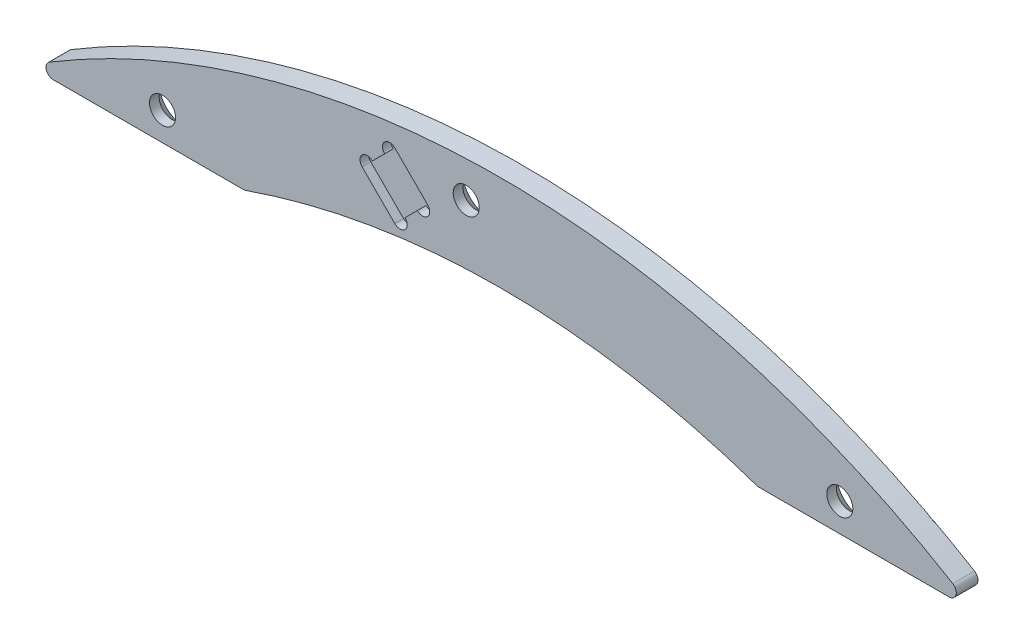
ISO-10303-21;
HEADER;
FILE_DESCRIPTION(('STEP AP214'),'2;1');
FILE_NAME('part.step','',(''),(''),'','','');
FILE_SCHEMA(('AUTOMOTIVE_DESIGN { 1 0 10303 214 1 1 1 1 }'));
ENDSEC;
DATA;
#1=APPLICATION_CONTEXT('core data for automotive mechanical design processes');
#2=APPLICATION_PROTOCOL_DEFINITION('international standard','automotive_design',2000,#1);
#3=PRODUCT_CONTEXT('',#1,'mechanical');
#4=PRODUCT('Part','Part','',(#3));
#5=PRODUCT_RELATED_PRODUCT_CATEGORY('part','',(#4));
#6=PRODUCT_DEFINITION_FORMATION('','',#4);
#7=PRODUCT_DEFINITION_CONTEXT('part definition',#1,'design');
#8=PRODUCT_DEFINITION('design','',#6,#7);
#9=PRODUCT_DEFINITION_SHAPE('','',#8);
#10=(LENGTH_UNIT() NAMED_UNIT(*) SI_UNIT(.MILLI.,.METRE.));
#11=(NAMED_UNIT(*) PLANE_ANGLE_UNIT() SI_UNIT($,.RADIAN.));
#12=(NAMED_UNIT(*) SI_UNIT($,.STERADIAN.) SOLID_ANGLE_UNIT());
#13=UNCERTAINTY_MEASURE_WITH_UNIT(LENGTH_MEASURE(1.E-05),#10,'distance_accuracy_value','');
#14=(GEOMETRIC_REPRESENTATION_CONTEXT(3) GLOBAL_UNCERTAINTY_ASSIGNED_CONTEXT((#13)) GLOBAL_UNIT_ASSIGNED_CONTEXT((#10,
#11,#12)) REPRESENTATION_CONTEXT('',''));
#15=CARTESIAN_POINT('',(0.,0.,0.));
#16=DIRECTION('',(0.,0.,1.));
#17=DIRECTION('',(1.,0.,0.));
#18=AXIS2_PLACEMENT_3D('',#15,#16,#17);
#19=CARTESIAN_POINT('',(0.,0.,-11.25));
#20=DIRECTION('',(0.,0.,1.));
#21=DIRECTION('',(-1.,0.,0.));
#22=AXIS2_PLACEMENT_3D('',#19,#20,#21);
#23=CYLINDRICAL_SURFACE('',#22,269.460029069767);
#24=CARTESIAN_POINT('',(0.,0.,-3.75));
#25=DIRECTION('',(0.,0.,-1.));
#26=DIRECTION('',(1.,0.,0.));
#27=AXIS2_PLACEMENT_3D('',#24,#25,#26);
#28=CIRCLE('',#27,269.460029069767);
#29=CARTESIAN_POINT('',(-88.6498780151052,254.460029069767,-3.75));
#30=VERTEX_POINT('',#29);
#31=CARTESIAN_POINT('',(88.6498780151052,254.460029069767,-3.75));
#32=VERTEX_POINT('',#31);
#33=EDGE_CURVE('E243',#30,#32,#28,.T.);
#34=ORIENTED_EDGE('',*,*,#33,.F.);
#35=DIRECTION('',(0.,0.,1.));
#36=VECTOR('',#35,1.);
#37=CARTESIAN_POINT('',(-88.6498780151052,254.460029069767,-11.25));
#38=LINE('',#37,#36);
#39=CARTESIAN_POINT('',(-88.6498780151052,254.460029069767,-11.25));
#40=VERTEX_POINT('',#39);
#41=EDGE_CURVE('E263',#40,#30,#38,.T.);
#42=ORIENTED_EDGE('',*,*,#41,.F.);
#43=CARTESIAN_POINT('',(0.,0.,-11.25));
#44=DIRECTION('',(0.,0.,-1.));
#45=DIRECTION('',(1.,0.,0.));
#46=AXIS2_PLACEMENT_3D('',#43,#44,#45);
#47=CIRCLE('',#46,269.460029069767);
#48=CARTESIAN_POINT('',(88.6498780151052,254.460029069767,-11.25));
#49=VERTEX_POINT('',#48);
#50=EDGE_CURVE('E244',#40,#49,#47,.T.);
#51=ORIENTED_EDGE('',*,*,#50,.T.);
#52=DIRECTION('',(0.,0.,1.));
#53=VECTOR('',#52,1.);
#54=CARTESIAN_POINT('',(88.6498780151052,254.460029069767,-11.25));
#55=LINE('',#54,#53);
#56=EDGE_CURVE('E51',#49,#32,#55,.T.);
#57=ORIENTED_EDGE('',*,*,#56,.T.);
#58=EDGE_LOOP('',(#34,#42,#51,#57));
#59=FACE_BOUND('',#58,.T.);
#60=ADVANCED_FACE('F39',(#59),#23,.F.);
#61=CARTESIAN_POINT('',(88.6498780151052,254.460029069767,-11.25));
#62=DIRECTION('',(0.,1.,0.));
#63=DIRECTION('',(-1.,0.,0.));
#64=AXIS2_PLACEMENT_3D('',#61,#62,#63);
#65=PLANE('',#64);
#66=DIRECTION('',(1.,0.,0.));
#67=VECTOR('',#66,1.);
#68=CARTESIAN_POINT('',(88.6498780151052,254.460029069767,-3.75));
#69=LINE('',#68,#67);
#70=CARTESIAN_POINT('',(154.75,254.460029069768,-3.75));
#71=VERTEX_POINT('',#70);
#72=EDGE_CURVE('E266',#32,#71,#69,.T.);
#73=ORIENTED_EDGE('',*,*,#72,.F.);
#74=ORIENTED_EDGE('',*,*,#56,.F.);
#75=DIRECTION('',(1.,0.,0.));
#76=VECTOR('',#75,1.);
#77=CARTESIAN_POINT('',(88.6498780151052,254.460029069767,-11.25));
#78=LINE('',#77,#76);
#79=CARTESIAN_POINT('',(154.75,254.460029069768,-11.25));
#80=VERTEX_POINT('',#79);
#81=EDGE_CURVE('E247',#49,#80,#78,.T.);
#82=ORIENTED_EDGE('',*,*,#81,.T.);
#83=DIRECTION('',(0.,0.,1.));
#84=VECTOR('',#83,1.);
#85=CARTESIAN_POINT('',(154.75,254.460029069768,-11.25));
#86=LINE('',#85,#84);
#87=EDGE_CURVE('E290',#80,#71,#86,.T.);
#88=ORIENTED_EDGE('',*,*,#87,.T.);
#89=EDGE_LOOP('',(#73,#74,#82,#88));
#90=FACE_BOUND('',#89,.T.);
#91=ADVANCED_FACE('F306',(#90),#65,.F.);
#92=CARTESIAN_POINT('',(154.75,256.960029069768,-11.25));
#93=DIRECTION('',(0.,0.,1.));
#94=DIRECTION('',(-1.,0.,0.));
#95=AXIS2_PLACEMENT_3D('',#92,#93,#94);
#96=CYLINDRICAL_SURFACE('',#95,2.50000000000002);
#97=CARTESIAN_POINT('',(154.75,256.960029069768,-3.75));
#98=DIRECTION('',(0.,0.,1.));
#99=DIRECTION('',(-1.,0.,0.));
#100=AXIS2_PLACEMENT_3D('',#97,#98,#99);
#101=CIRCLE('',#100,2.50000000000002);
#102=CARTESIAN_POINT('',(156.039755175714,259.101647987017,-3.75));
#103=VERTEX_POINT('',#102);
#104=EDGE_CURVE('E269',#71,#103,#101,.T.);
#105=ORIENTED_EDGE('',*,*,#104,.F.);
#106=ORIENTED_EDGE('',*,*,#87,.F.);
#107=CARTESIAN_POINT('',(154.75,256.960029069768,-11.25));
#108=DIRECTION('',(0.,0.,1.));
#109=DIRECTION('',(-1.,0.,0.));
#110=AXIS2_PLACEMENT_3D('',#107,#108,#109);
#111=CIRCLE('',#110,2.50000000000002);
#112=CARTESIAN_POINT('',(156.039755175714,259.101647987017,-11.25));
#113=VERTEX_POINT('',#112);
#114=EDGE_CURVE('E251',#80,#113,#111,.T.);
#115=ORIENTED_EDGE('',*,*,#114,.T.);
#116=DIRECTION('',(0.,0.,1.));
#117=VECTOR('',#116,1.);
#118=CARTESIAN_POINT('',(156.039755175714,259.101647987017,-11.25));
#119=LINE('',#118,#117);
#120=EDGE_CURVE('E287',#113,#103,#119,.T.);
#121=ORIENTED_EDGE('',*,*,#120,.T.);
#122=EDGE_LOOP('',(#105,#106,#115,#121));
#123=FACE_BOUND('',#122,.T.);
#124=ADVANCED_FACE('F308',(#123),#96,.T.);
#125=CARTESIAN_POINT('',(0.,0.,-11.25));
#126=DIRECTION('',(0.,0.,1.));
#127=DIRECTION('',(-1.,0.,0.));
#128=AXIS2_PLACEMENT_3D('',#125,#126,#127);
#129=CYLINDRICAL_SURFACE('',#128,302.460029069768);
#130=CARTESIAN_POINT('',(0.,0.,-11.25));
#131=DIRECTION('',(0.,0.,1.));
#132=DIRECTION('',(1.,0.,0.));
#133=AXIS2_PLACEMENT_3D('',#130,#131,#132);
#134=CIRCLE('',#133,302.460029069768);
#135=CARTESIAN_POINT('',(139.908199105441,268.156232461519,-11.25));
#136=VERTEX_POINT('',#135);
#137=CARTESIAN_POINT('',(-156.039755175714,259.101647987017,-11.25));
#138=VERTEX_POINT('',#137);
#139=EDGE_CURVE('E254',#136,#138,#134,.T.);
#140=ORIENTED_EDGE('',*,*,#139,.T.);
#141=DIRECTION('',(0.,0.,1.));
#142=VECTOR('',#141,1.);
#143=CARTESIAN_POINT('',(-156.039755175714,259.101647987017,-11.25));
#144=LINE('',#143,#142);
#145=CARTESIAN_POINT('',(-156.039755175714,259.101647987017,-3.75));
#146=VERTEX_POINT('',#145);
#147=EDGE_CURVE('E284',#138,#146,#144,.T.);
#148=ORIENTED_EDGE('',*,*,#147,.T.);
#149=CARTESIAN_POINT('',(0.,0.,-3.75));
#150=DIRECTION('',(0.,0.,1.));
#151=DIRECTION('',(1.,0.,0.));
#152=AXIS2_PLACEMENT_3D('',#149,#150,#151);
#153=CIRCLE('',#152,302.460029069768);
#154=EDGE_CURVE('E272',#103,#146,#153,.T.);
#155=ORIENTED_EDGE('',*,*,#154,.F.);
#156=ORIENTED_EDGE('',*,*,#120,.F.);
#157=CARTESIAN_POINT('',(142.641129207056,266.712537094566,-11.25));
#158=VERTEX_POINT('',#157);
#159=EDGE_CURVE('E255',#113,#158,#134,.T.);
#160=ORIENTED_EDGE('',*,*,#159,.T.);
#161=CARTESIAN_POINT('',(132.619219648402,271.83489798908,-15.6115804640722));
#162=CARTESIAN_POINT('',(132.834596791155,271.72982163131,-15.4277852509238));
#163=CARTESIAN_POINT('',(133.051087469922,271.623887092947,-15.2457549907613));
#164=CARTESIAN_POINT('',(133.486790906237,271.410030936583,-14.8860345886712));
#165=CARTESIAN_POINT('',(133.706004415415,271.302108765744,-14.7083456872187));
#166=CARTESIAN_POINT('',(134.149335410221,271.083172809987,-14.3567892377176));
#167=CARTESIAN_POINT('',(134.373478355662,270.972140943511,-14.1829649064337));
#168=CARTESIAN_POINT('',(134.825430855283,270.747550427584,-13.8418653869027));
#169=CARTESIAN_POINT('',(135.053240080029,270.633992004812,-13.6745896148179));
#170=CARTESIAN_POINT('',(135.518238879471,270.401451885659,-13.3444821739536));
#171=CARTESIAN_POINT('',(135.755524501654,270.282405801571,-13.1818303146494));
#172=CARTESIAN_POINT('',(136.235360150961,270.040863552464,-12.8670177127516));
#173=CARTESIAN_POINT('',(136.477911111874,269.918366774312,-12.7148588513715));
#174=CARTESIAN_POINT('',(136.96815021038,269.669928398661,-12.4242997826955));
#175=CARTESIAN_POINT('',(137.215818424359,269.543999711008,-12.2858552065004));
#176=CARTESIAN_POINT('',(137.717620099305,269.287960292444,-12.0256797280574));
#177=CARTESIAN_POINT('',(137.971750031574,269.157851834266,-11.9039399263188));
#178=CARTESIAN_POINT('',(138.365602237278,268.955484783335,-11.7337815301168));
#179=CARTESIAN_POINT('',(138.502893573918,268.884811489796,-11.6778158478733));
#180=CARTESIAN_POINT('',(138.779385264753,268.74221032141,-11.5724610049396));
#181=CARTESIAN_POINT('',(138.918585943761,268.670282232519,-11.5230729789231));
#182=CARTESIAN_POINT('',(139.198459564904,268.525385785394,-11.431722431058));
#183=CARTESIAN_POINT('',(139.339128577233,268.452420075009,-11.3897437530616));
#184=CARTESIAN_POINT('',(139.622055436372,268.305378706963,-11.3137966635688));
#185=CARTESIAN_POINT('',(139.764313370396,268.231302988297,-11.2798286940537));
#186=CARTESIAN_POINT('',(140.094196106521,268.05919092913,-11.2114411722898));
#187=CARTESIAN_POINT('',(140.282292330875,267.960805126015,-11.1801079773471));
#188=CARTESIAN_POINT('',(140.659867921804,267.762798360052,-11.1334829727245));
#189=CARTESIAN_POINT('',(140.849347479274,267.663177225355,-11.1181934208229));
#190=CARTESIAN_POINT('',(141.228465171578,267.463335245953,-11.1042888746488));
#191=CARTESIAN_POINT('',(141.418103152349,267.363114779461,-11.1056642872103));
#192=CARTESIAN_POINT('',(141.796440150967,267.162655601208,-11.125012196741));
#193=CARTESIAN_POINT('',(141.985139510059,267.062416912283,-11.1429781388476));
#194=CARTESIAN_POINT('',(142.251451358853,266.920590663808,-11.1797035878287));
#195=CARTESIAN_POINT('',(142.329892272458,266.878771756867,-11.1919343272055));
#196=CARTESIAN_POINT('',(142.486325107912,266.795285188644,-11.2190769315639));
#197=CARTESIAN_POINT('',(142.564317275037,266.7536174505,-11.2339871520843));
#198=CARTESIAN_POINT('',(142.871788062169,266.589176741619,-11.2980846923937));
#199=CARTESIAN_POINT('',(143.099564268443,266.466975780521,-11.3573324367737));
#200=CARTESIAN_POINT('',(143.437545135743,266.285103391195,-11.4610932660269));
#201=CARTESIAN_POINT('',(143.549707015845,266.224654897987,-11.4982084318327));
#202=CARTESIAN_POINT('',(143.772658966028,266.104317398409,-11.5769993223133));
#203=CARTESIAN_POINT('',(143.883449579161,266.044428173023,-11.618673172834));
#204=CARTESIAN_POINT('',(143.993570671845,265.984813081606,-11.6624422617585));
#205=B_SPLINE_CURVE_WITH_KNOTS('',3,(#161,#162,#163,#164,#165,#166,#167,#168,#169,#170,#171,
#172,#173,#174,#175,#176,#177,#178,#179,#180,#181,#182,#183,#184,#185,#186,#187,#188,#189,#190,
#191,#192,#193,#194,#195,#196,#197,#198,#199,#200,#201,#202,#203,#204),.UNSPECIFIED.,.F.,.F.,(4,
2,2,2,2,2,2,2,2,2,2,2,2,2,2,2,2,2,2,2,2,4),(0.,0.906044276811157,1.81234448348939,
2.72606745065087,3.6397087683376,4.57353350298285,5.50752522337396,6.43838917044575,
7.36875525695322,7.86136221844393,8.35405404697245,8.84565791526838,9.33728890088448,
9.98041683065181,10.6236352539362,11.266483426935,11.9090777213901,12.1782326675863,
12.4472229876586,13.2416866624306,13.6397529346652,14.0376561656928),.UNSPECIFIED.);
#206=EDGE_CURVE('E11',#136,#158,#205,.T.);
#207=ORIENTED_EDGE('',*,*,#206,.F.);
#208=EDGE_LOOP('',(#140,#148,#155,#156,#160,#207));
#209=FACE_BOUND('',#208,.T.);
#210=ADVANCED_FACE('F313',(#209),#129,.T.);
#211=CARTESIAN_POINT('',(-154.75,256.960029069767,-11.25));
#212=DIRECTION('',(0.,0.,1.));
#213=DIRECTION('',(-1.,0.,0.));
#214=AXIS2_PLACEMENT_3D('',#211,#212,#213);
#215=CYLINDRICAL_SURFACE('',#214,2.49999999999999);
#216=CARTESIAN_POINT('',(-154.75,256.960029069767,-3.75));
#217=DIRECTION('',(0.,0.,1.));
#218=DIRECTION('',(1.,0.,0.));
#219=AXIS2_PLACEMENT_3D('',#216,#217,#218);
#220=CIRCLE('',#219,2.49999999999999);
#221=CARTESIAN_POINT('',(-154.75,254.460029069768,-3.75));
#222=VERTEX_POINT('',#221);
#223=EDGE_CURVE('E275',#146,#222,#220,.T.);
#224=ORIENTED_EDGE('',*,*,#223,.F.);
#225=ORIENTED_EDGE('',*,*,#147,.F.);
#226=CARTESIAN_POINT('',(-154.75,256.960029069767,-11.25));
#227=DIRECTION('',(0.,0.,1.));
#228=DIRECTION('',(1.,0.,0.));
#229=AXIS2_PLACEMENT_3D('',#226,#227,#228);
#230=CIRCLE('',#229,2.49999999999999);
#231=CARTESIAN_POINT('',(-154.75,254.460029069768,-11.25));
#232=VERTEX_POINT('',#231);
#233=EDGE_CURVE('E258',#138,#232,#230,.T.);
#234=ORIENTED_EDGE('',*,*,#233,.T.);
#235=DIRECTION('',(0.,0.,1.));
#236=VECTOR('',#235,1.);
#237=CARTESIAN_POINT('',(-154.75,254.460029069768,-11.25));
#238=LINE('',#237,#236);
#239=EDGE_CURVE('E281',#232,#222,#238,.T.);
#240=ORIENTED_EDGE('',*,*,#239,.T.);
#241=EDGE_LOOP('',(#224,#225,#234,#240));
#242=FACE_BOUND('',#241,.T.);
#243=ADVANCED_FACE('F316',(#242),#215,.T.);
#244=CARTESIAN_POINT('',(-154.75,254.460029069768,-11.25));
#245=DIRECTION('',(0.,1.,0.));
#246=DIRECTION('',(-1.,0.,0.));
#247=AXIS2_PLACEMENT_3D('',#244,#245,#246);
#248=PLANE('',#247);
#249=DIRECTION('',(1.,0.,0.));
#250=VECTOR('',#249,1.);
#251=CARTESIAN_POINT('',(-154.75,254.460029069768,-3.75));
#252=LINE('',#251,#250);
#253=EDGE_CURVE('E248',#222,#30,#252,.T.);
#254=ORIENTED_EDGE('',*,*,#253,.F.);
#255=ORIENTED_EDGE('',*,*,#239,.F.);
#256=DIRECTION('',(1.,0.,0.));
#257=VECTOR('',#256,1.);
#258=CARTESIAN_POINT('',(-154.75,254.460029069768,-11.25));
#259=LINE('',#258,#257);
#260=EDGE_CURVE('E261',#232,#40,#259,.T.);
#261=ORIENTED_EDGE('',*,*,#260,.T.);
#262=ORIENTED_EDGE('',*,*,#41,.T.);
#263=EDGE_LOOP('',(#254,#255,#261,#262));
#264=FACE_BOUND('',#263,.T.);
#265=ADVANCED_FACE('F303',(#264),#248,.F.);
#266=CARTESIAN_POINT('',(0.,0.,-11.25));
#267=DIRECTION('',(0.,0.,-1.));
#268=DIRECTION('',(1.,0.,0.));
#269=AXIS2_PLACEMENT_3D('',#266,#267,#268);
#270=PLANE('',#269);
#271=CARTESIAN_POINT('',(-12.0579457489201,289.731675965508,-11.25));
#272=DIRECTION('',(0.,0.,1.));
#273=DIRECTION('',(1.,0.,0.));
#274=AXIS2_PLACEMENT_3D('',#271,#272,#273);
#275=CIRCLE('',#274,8.65);
#276=CARTESIAN_POINT('',(-3.40794574892014,289.731675965508,-11.25));
#277=VERTEX_POINT('',#276);
#278=EDGE_CURVE('E204',#277,#277,#275,.T.);
#279=ORIENTED_EDGE('',*,*,#278,.T.);
#280=EDGE_LOOP('',(#279));
#281=FACE_BOUND('',#280,.T.);
#282=CARTESIAN_POINT('',(117.,264.213736206127,-11.25));
#283=DIRECTION('',(0.,0.,1.));
#284=DIRECTION('',(1.,0.,0.));
#285=AXIS2_PLACEMENT_3D('',#282,#283,#284);
#286=CIRCLE('',#285,8.65000000000001);
#287=CARTESIAN_POINT('',(125.65,264.213736206127,-11.25));
#288=VERTEX_POINT('',#287);
#289=EDGE_CURVE('E224',#288,#288,#286,.T.);
#290=ORIENTED_EDGE('',*,*,#289,.T.);
#291=EDGE_LOOP('',(#290));
#292=FACE_BOUND('',#291,.T.);
#293=CARTESIAN_POINT('',(-117.,264.213736206127,-11.25));
#294=DIRECTION('',(0.,0.,1.));
#295=DIRECTION('',(1.,0.,0.));
#296=AXIS2_PLACEMENT_3D('',#293,#294,#295);
#297=CIRCLE('',#296,8.65000000000001);
#298=CARTESIAN_POINT('',(-108.35,264.213736206127,-11.25));
#299=VERTEX_POINT('',#298);
#300=EDGE_CURVE('E233',#299,#299,#297,.T.);
#301=ORIENTED_EDGE('',*,*,#300,.T.);
#302=EDGE_LOOP('',(#301));
#303=FACE_BOUND('',#302,.T.);
#304=CARTESIAN_POINT('',(145.25,274.959736206127,-11.25));
#305=DIRECTION('',(0.,0.,1.));
#306=DIRECTION('',(1.,0.,0.));
#307=AXIS2_PLACEMENT_3D('',#304,#305,#306);
#308=CIRCLE('',#307,8.64999999999999);
#309=EDGE_CURVE('E66',#136,#158,#308,.T.);
#310=ORIENTED_EDGE('',*,*,#309,.T.);
#311=ORIENTED_EDGE('',*,*,#159,.F.);
#312=ORIENTED_EDGE('',*,*,#114,.F.);
#313=ORIENTED_EDGE('',*,*,#81,.F.);
#314=ORIENTED_EDGE('',*,*,#50,.F.);
#315=ORIENTED_EDGE('',*,*,#260,.F.);
#316=ORIENTED_EDGE('',*,*,#233,.F.);
#317=ORIENTED_EDGE('',*,*,#139,.F.);
#318=EDGE_LOOP('',(#310,#311,#312,#313,#314,#315,#316,#317));
#319=FACE_BOUND('',#318,.T.);
#320=ADVANCED_FACE('F304',(#281,#292,#303,#319),#270,.T.);
#321=CARTESIAN_POINT('',(0.,0.,-3.75));
#322=DIRECTION('',(0.,0.,-1.));
#323=DIRECTION('',(1.,0.,0.));
#324=AXIS2_PLACEMENT_3D('',#321,#322,#323);
#325=PLANE('',#324);
#326=DIRECTION('',(-0.707106781186557,-0.707106781186538,0.));
#327=VECTOR('',#326,1.);
#328=CARTESIAN_POINT('',(-33.1985948574976,273.970586651553,-3.75));
#329=LINE('',#328,#327);
#330=CARTESIAN_POINT('',(-28.9559541703783,278.213227338672,-3.75));
#331=VERTEX_POINT('',#330);
#332=CARTESIAN_POINT('',(-33.1985948574976,273.970586651553,-3.75));
#333=VERTEX_POINT('',#332);
#334=EDGE_CURVE('E164',#331,#333,#329,.T.);
#335=ORIENTED_EDGE('',*,*,#334,.T.);
#336=CARTESIAN_POINT('',(-34.966361810464,272.202819698587,-3.75));
#337=DIRECTION('',(0.,0.,-1.));
#338=DIRECTION('',(1.,0.,0.));
#339=AXIS2_PLACEMENT_3D('',#336,#337,#338);
#340=CIRCLE('',#339,2.49999999999998);
#341=CARTESIAN_POINT('',(-36.7341287634303,270.435052745621,-3.75));
#342=VERTEX_POINT('',#341);
#343=EDGE_CURVE('E189',#333,#342,#340,.T.);
#344=ORIENTED_EDGE('',*,*,#343,.T.);
#345=DIRECTION('',(-0.707106781186542,0.707106781186553,0.));
#346=VECTOR('',#345,1.);
#347=CARTESIAN_POINT('',(-48.047837262415,281.748761244605,-3.75));
#348=LINE('',#347,#346);
#349=CARTESIAN_POINT('',(-48.047837262415,281.748761244605,-3.75));
#350=VERTEX_POINT('',#349);
#351=EDGE_CURVE('E192',#342,#350,#348,.T.);
#352=ORIENTED_EDGE('',*,*,#351,.T.);
#353=CARTESIAN_POINT('',(-46.2800703094486,283.516528197572,-3.75));
#354=DIRECTION('',(0.,0.,-1.));
#355=DIRECTION('',(1.,0.,0.));
#356=AXIS2_PLACEMENT_3D('',#353,#354,#355);
#357=CIRCLE('',#356,2.49999999999998);
#358=CARTESIAN_POINT('',(-44.5123033564823,285.284295150538,-3.75));
#359=VERTEX_POINT('',#358);
#360=EDGE_CURVE('E195',#350,#359,#357,.T.);
#361=ORIENTED_EDGE('',*,*,#360,.T.);
#362=DIRECTION('',(0.707106781186554,0.707106781186541,0.));
#363=VECTOR('',#362,1.);
#364=CARTESIAN_POINT('',(-40.269662669363,289.526935837657,-3.75));
#365=LINE('',#364,#363);
#366=CARTESIAN_POINT('',(-40.269662669363,289.526935837657,-3.75));
#367=VERTEX_POINT('',#366);
#368=EDGE_CURVE('E198',#359,#367,#365,.T.);
#369=ORIENTED_EDGE('',*,*,#368,.T.);
#370=CARTESIAN_POINT('',(-38.5018957163966,291.294702790624,-3.75));
#371=DIRECTION('',(0.,0.,-1.));
#372=DIRECTION('',(1.,0.,0.));
#373=AXIS2_PLACEMENT_3D('',#370,#371,#372);
#374=CIRCLE('',#373,2.50000000000002);
#375=CARTESIAN_POINT('',(-36.7341287634302,293.06246974359,-3.75));
#376=VERTEX_POINT('',#375);
#377=EDGE_CURVE('E173',#367,#376,#374,.T.);
#378=ORIENTED_EDGE('',*,*,#377,.T.);
#379=DIRECTION('',(0.707106781186543,-0.707106781186552,0.));
#380=VECTOR('',#379,1.);
#381=CARTESIAN_POINT('',(-25.4204202644455,281.748761244605,-3.75));
#382=LINE('',#381,#380);
#383=CARTESIAN_POINT('',(-25.4204202644455,281.748761244605,-3.75));
#384=VERTEX_POINT('',#383);
#385=EDGE_CURVE('E170',#376,#384,#382,.T.);
#386=ORIENTED_EDGE('',*,*,#385,.T.);
#387=CARTESIAN_POINT('',(-27.1881872174119,279.980994291639,-3.75));
#388=DIRECTION('',(0.,0.,-1.));
#389=DIRECTION('',(1.,0.,0.));
#390=AXIS2_PLACEMENT_3D('',#387,#388,#389);
#391=CIRCLE('',#390,2.50000000000002);
#392=EDGE_CURVE('E186',#384,#331,#391,.T.);
#393=ORIENTED_EDGE('',*,*,#392,.T.);
#394=EDGE_LOOP('',(#335,#344,#352,#361,#369,#378,#386,#393));
#395=FACE_BOUND('',#394,.T.);
#396=CARTESIAN_POINT('',(-12.0579457489201,289.731675965508,-3.75));
#397=DIRECTION('',(0.,0.,1.));
#398=DIRECTION('',(1.,0.,0.));
#399=AXIS2_PLACEMENT_3D('',#396,#397,#398);
#400=CIRCLE('',#399,4.5);
#401=CARTESIAN_POINT('',(-7.55794574892014,289.731675965508,-3.75));
#402=VERTEX_POINT('',#401);
#403=EDGE_CURVE('E221',#402,#402,#400,.T.);
#404=ORIENTED_EDGE('',*,*,#403,.F.);
#405=EDGE_LOOP('',(#404));
#406=FACE_BOUND('',#405,.T.);
#407=CARTESIAN_POINT('',(117.,264.213736206127,-3.75));
#408=DIRECTION('',(0.,0.,1.));
#409=DIRECTION('',(1.,0.,0.));
#410=AXIS2_PLACEMENT_3D('',#407,#408,#409);
#411=CIRCLE('',#410,4.5);
#412=CARTESIAN_POINT('',(121.5,264.213736206127,-3.75));
#413=VERTEX_POINT('',#412);
#414=EDGE_CURVE('E230',#413,#413,#411,.T.);
#415=ORIENTED_EDGE('',*,*,#414,.F.);
#416=EDGE_LOOP('',(#415));
#417=FACE_BOUND('',#416,.T.);
#418=CARTESIAN_POINT('',(-117.,264.213736206127,-3.75));
#419=DIRECTION('',(0.,0.,1.));
#420=DIRECTION('',(1.,0.,0.));
#421=AXIS2_PLACEMENT_3D('',#418,#419,#420);
#422=CIRCLE('',#421,4.5);
#423=CARTESIAN_POINT('',(-112.5,264.213736206127,-3.75));
#424=VERTEX_POINT('',#423);
#425=EDGE_CURVE('E239',#424,#424,#422,.T.);
#426=ORIENTED_EDGE('',*,*,#425,.F.);
#427=EDGE_LOOP('',(#426));
#428=FACE_BOUND('',#427,.T.);
#429=ORIENTED_EDGE('',*,*,#33,.T.);
#430=ORIENTED_EDGE('',*,*,#72,.T.);
#431=ORIENTED_EDGE('',*,*,#104,.T.);
#432=ORIENTED_EDGE('',*,*,#154,.T.);
#433=ORIENTED_EDGE('',*,*,#223,.T.);
#434=ORIENTED_EDGE('',*,*,#253,.T.);
#435=EDGE_LOOP('',(#429,#430,#431,#432,#433,#434));
#436=FACE_BOUND('',#435,.T.);
#437=ADVANCED_FACE('F300',(#395,#406,#417,#428,#436),#325,.F.);
#438=CARTESIAN_POINT('',(145.25,274.959736206127,-11.25));
#439=DIRECTION('',(0.,0.,-1.));
#440=DIRECTION('',(1.,0.,0.));
#441=AXIS2_PLACEMENT_3D('',#438,#439,#440);
#442=CONICAL_SURFACE('',#441,8.64999999999999,0.785398163397447);
#443=ORIENTED_EDGE('',*,*,#309,.F.);
#444=ORIENTED_EDGE('',*,*,#206,.T.);
#445=EDGE_LOOP('',(#443,#444));
#446=FACE_BOUND('',#445,.T.);
#447=ADVANCED_FACE('F367',(#446),#442,.F.);
#448=CARTESIAN_POINT('',(-117.,264.213736206127,-11.25));
#449=DIRECTION('',(0.,0.,-1.));
#450=DIRECTION('',(1.,0.,0.));
#451=AXIS2_PLACEMENT_3D('',#448,#449,#450);
#452=CYLINDRICAL_SURFACE('',#451,4.5);
#453=ORIENTED_EDGE('',*,*,#425,.T.);
#454=EDGE_LOOP('',(#453));
#455=FACE_BOUND('',#454,.T.);
#456=CARTESIAN_POINT('',(-117.,264.213736206127,-7.1));
#457=DIRECTION('',(0.,0.,1.));
#458=DIRECTION('',(1.,0.,0.));
#459=AXIS2_PLACEMENT_3D('',#456,#457,#458);
#460=CIRCLE('',#459,4.5);
#461=CARTESIAN_POINT('',(-112.5,264.213736206127,-7.1));
#462=VERTEX_POINT('',#461);
#463=EDGE_CURVE('E236',#462,#462,#460,.T.);
#464=ORIENTED_EDGE('',*,*,#463,.F.);
#465=EDGE_LOOP('',(#464));
#466=FACE_BOUND('',#465,.T.);
#467=ADVANCED_FACE('F377',(#455,#466),#452,.F.);
#468=CARTESIAN_POINT('',(-117.,264.213736206127,-11.25));
#469=DIRECTION('',(0.,0.,-1.));
#470=DIRECTION('',(1.,0.,0.));
#471=AXIS2_PLACEMENT_3D('',#468,#469,#470);
#472=CONICAL_SURFACE('',#471,8.65000000000001,0.785398163397449);
#473=ORIENTED_EDGE('',*,*,#463,.T.);
#474=EDGE_LOOP('',(#473));
#475=FACE_BOUND('',#474,.T.);
#476=ORIENTED_EDGE('',*,*,#300,.F.);
#477=EDGE_LOOP('',(#476));
#478=FACE_BOUND('',#477,.T.);
#479=ADVANCED_FACE('F386',(#475,#478),#472,.F.);
#480=CARTESIAN_POINT('',(117.,264.213736206127,-11.25));
#481=DIRECTION('',(0.,0.,-1.));
#482=DIRECTION('',(1.,0.,0.));
#483=AXIS2_PLACEMENT_3D('',#480,#481,#482);
#484=CYLINDRICAL_SURFACE('',#483,4.5);
#485=ORIENTED_EDGE('',*,*,#414,.T.);
#486=EDGE_LOOP('',(#485));
#487=FACE_BOUND('',#486,.T.);
#488=CARTESIAN_POINT('',(117.,264.213736206127,-7.1));
#489=DIRECTION('',(0.,0.,1.));
#490=DIRECTION('',(1.,0.,0.));
#491=AXIS2_PLACEMENT_3D('',#488,#489,#490);
#492=CIRCLE('',#491,4.5);
#493=CARTESIAN_POINT('',(121.5,264.213736206127,-7.1));
#494=VERTEX_POINT('',#493);
#495=EDGE_CURVE('E227',#494,#494,#492,.T.);
#496=ORIENTED_EDGE('',*,*,#495,.F.);
#497=EDGE_LOOP('',(#496));
#498=FACE_BOUND('',#497,.T.);
#499=ADVANCED_FACE('F396',(#487,#498),#484,.F.);
#500=CARTESIAN_POINT('',(117.,264.213736206127,-11.25));
#501=DIRECTION('',(0.,0.,-1.));
#502=DIRECTION('',(1.,0.,0.));
#503=AXIS2_PLACEMENT_3D('',#500,#501,#502);
#504=CONICAL_SURFACE('',#503,8.65000000000001,0.785398163397449);
#505=ORIENTED_EDGE('',*,*,#495,.T.);
#506=EDGE_LOOP('',(#505));
#507=FACE_BOUND('',#506,.T.);
#508=ORIENTED_EDGE('',*,*,#289,.F.);
#509=EDGE_LOOP('',(#508));
#510=FACE_BOUND('',#509,.T.);
#511=ADVANCED_FACE('F406',(#507,#510),#504,.F.);
#512=CARTESIAN_POINT('',(-12.0579457489201,289.731675965508,-11.25));
#513=DIRECTION('',(0.,0.,-1.));
#514=DIRECTION('',(1.,0.,0.));
#515=AXIS2_PLACEMENT_3D('',#512,#513,#514);
#516=CYLINDRICAL_SURFACE('',#515,4.5);
#517=ORIENTED_EDGE('',*,*,#403,.T.);
#518=EDGE_LOOP('',(#517));
#519=FACE_BOUND('',#518,.T.);
#520=CARTESIAN_POINT('',(-12.0579457489201,289.731675965508,-7.1));
#521=DIRECTION('',(0.,0.,1.));
#522=DIRECTION('',(1.,0.,0.));
#523=AXIS2_PLACEMENT_3D('',#520,#521,#522);
#524=CIRCLE('',#523,4.5);
#525=CARTESIAN_POINT('',(-7.55794574892014,289.731675965508,-7.1));
#526=VERTEX_POINT('',#525);
#527=EDGE_CURVE('E218',#526,#526,#524,.T.);
#528=ORIENTED_EDGE('',*,*,#527,.F.);
#529=EDGE_LOOP('',(#528));
#530=FACE_BOUND('',#529,.T.);
#531=ADVANCED_FACE('F416',(#519,#530),#516,.F.);
#532=CARTESIAN_POINT('',(-12.0579457489201,289.731675965508,-11.25));
#533=DIRECTION('',(0.,0.,-1.));
#534=DIRECTION('',(1.,0.,0.));
#535=AXIS2_PLACEMENT_3D('',#532,#533,#534);
#536=CONICAL_SURFACE('',#535,8.65,0.785398163397448);
#537=ORIENTED_EDGE('',*,*,#527,.T.);
#538=EDGE_LOOP('',(#537));
#539=FACE_BOUND('',#538,.T.);
#540=ORIENTED_EDGE('',*,*,#278,.F.);
#541=EDGE_LOOP('',(#540));
#542=FACE_BOUND('',#541,.T.);
#543=ADVANCED_FACE('F426',(#539,#542),#536,.F.);
#544=CARTESIAN_POINT('',(-27.1881872174119,279.980994291639,-6.75));
#545=DIRECTION('',(0.,0.,1.));
#546=DIRECTION('',(-1.,0.,0.));
#547=AXIS2_PLACEMENT_3D('',#544,#545,#546);
#548=CYLINDRICAL_SURFACE('',#547,2.50000000000002);
#549=ORIENTED_EDGE('',*,*,#392,.F.);
#550=DIRECTION('',(0.,0.,1.));
#551=VECTOR('',#550,1.);
#552=CARTESIAN_POINT('',(-25.4204202644455,281.748761244605,-6.75));
#553=LINE('',#552,#551);
#554=CARTESIAN_POINT('',(-25.4204202644455,281.748761244605,-6.75));
#555=VERTEX_POINT('',#554);
#556=EDGE_CURVE('E169',#555,#384,#553,.T.);
#557=ORIENTED_EDGE('',*,*,#556,.F.);
#558=CARTESIAN_POINT('',(-27.1881872174119,279.980994291639,-6.75));
#559=DIRECTION('',(0.,0.,-1.));
#560=DIRECTION('',(1.,0.,0.));
#561=AXIS2_PLACEMENT_3D('',#558,#559,#560);
#562=CIRCLE('',#561,2.50000000000002);
#563=CARTESIAN_POINT('',(-28.9559541703783,278.213227338672,-6.75));
#564=VERTEX_POINT('',#563);
#565=EDGE_CURVE('E154',#555,#564,#562,.T.);
#566=ORIENTED_EDGE('',*,*,#565,.T.);
#567=DIRECTION('',(0.,0.,1.));
#568=VECTOR('',#567,1.);
#569=CARTESIAN_POINT('',(-28.9559541703783,278.213227338672,-6.75));
#570=LINE('',#569,#568);
#571=EDGE_CURVE('E58',#564,#331,#570,.T.);
#572=ORIENTED_EDGE('',*,*,#571,.T.);
#573=EDGE_LOOP('',(#549,#557,#566,#572));
#574=FACE_BOUND('',#573,.T.);
#575=ADVANCED_FACE('F168',(#574),#548,.F.);
#576=CARTESIAN_POINT('',(-25.4204202644455,281.748761244605,-6.75));
#577=DIRECTION('',(0.707106781186552,0.707106781186543,0.));
#578=DIRECTION('',(-0.707106781186543,0.707106781186552,0.));
#579=AXIS2_PLACEMENT_3D('',#576,#577,#578);
#580=PLANE('',#579);
#581=ORIENTED_EDGE('',*,*,#385,.F.);
#582=DIRECTION('',(0.,0.,1.));
#583=VECTOR('',#582,1.);
#584=CARTESIAN_POINT('',(-36.7341287634302,293.06246974359,-6.75));
#585=LINE('',#584,#583);
#586=CARTESIAN_POINT('',(-36.7341287634302,293.06246974359,-6.75));
#587=VERTEX_POINT('',#586);
#588=EDGE_CURVE('E205',#587,#376,#585,.T.);
#589=ORIENTED_EDGE('',*,*,#588,.F.);
#590=DIRECTION('',(0.707106781186543,-0.707106781186552,0.));
#591=VECTOR('',#590,1.);
#592=CARTESIAN_POINT('',(-25.4204202644455,281.748761244605,-6.75));
#593=LINE('',#592,#591);
#594=EDGE_CURVE('E166',#587,#555,#593,.T.);
#595=ORIENTED_EDGE('',*,*,#594,.T.);
#596=ORIENTED_EDGE('',*,*,#556,.T.);
#597=EDGE_LOOP('',(#581,#589,#595,#596));
#598=FACE_BOUND('',#597,.T.);
#599=ADVANCED_FACE('F445',(#598),#580,.F.);
#600=CARTESIAN_POINT('',(-38.5018957163966,291.294702790624,-6.75));
#601=DIRECTION('',(0.,0.,1.));
#602=DIRECTION('',(-1.,0.,0.));
#603=AXIS2_PLACEMENT_3D('',#600,#601,#602);
#604=CYLINDRICAL_SURFACE('',#603,2.50000000000002);
#605=ORIENTED_EDGE('',*,*,#377,.F.);
#606=DIRECTION('',(0.,0.,1.));
#607=VECTOR('',#606,1.);
#608=CARTESIAN_POINT('',(-40.269662669363,289.526935837657,-6.75));
#609=LINE('',#608,#607);
#610=CARTESIAN_POINT('',(-40.269662669363,289.526935837657,-6.75));
#611=VERTEX_POINT('',#610);
#612=EDGE_CURVE('E207',#611,#367,#609,.T.);
#613=ORIENTED_EDGE('',*,*,#612,.F.);
#614=CARTESIAN_POINT('',(-38.5018957163966,291.294702790624,-6.75));
#615=DIRECTION('',(0.,0.,-1.));
#616=DIRECTION('',(1.,0.,0.));
#617=AXIS2_PLACEMENT_3D('',#614,#615,#616);
#618=CIRCLE('',#617,2.50000000000002);
#619=EDGE_CURVE('E183',#611,#587,#618,.T.);
#620=ORIENTED_EDGE('',*,*,#619,.T.);
#621=ORIENTED_EDGE('',*,*,#588,.T.);
#622=EDGE_LOOP('',(#605,#613,#620,#621));
#623=FACE_BOUND('',#622,.T.);
#624=ADVANCED_FACE('F454',(#623),#604,.F.);
#625=CARTESIAN_POINT('',(-40.269662669363,289.526935837657,-6.75));
#626=DIRECTION('',(-0.707106781186541,0.707106781186554,0.));
#627=DIRECTION('',(-0.707106781186554,-0.707106781186541,0.));
#628=AXIS2_PLACEMENT_3D('',#625,#626,#627);
#629=PLANE('',#628);
#630=ORIENTED_EDGE('',*,*,#368,.F.);
#631=DIRECTION('',(0.,0.,1.));
#632=VECTOR('',#631,1.);
#633=CARTESIAN_POINT('',(-44.5123033564823,285.284295150538,-6.75));
#634=LINE('',#633,#632);
#635=CARTESIAN_POINT('',(-44.5123033564823,285.284295150538,-6.75));
#636=VERTEX_POINT('',#635);
#637=EDGE_CURVE('E209',#636,#359,#634,.T.);
#638=ORIENTED_EDGE('',*,*,#637,.F.);
#639=DIRECTION('',(0.707106781186554,0.707106781186541,0.));
#640=VECTOR('',#639,1.);
#641=CARTESIAN_POINT('',(-40.269662669363,289.526935837657,-6.75));
#642=LINE('',#641,#640);
#643=EDGE_CURVE('E181',#636,#611,#642,.T.);
#644=ORIENTED_EDGE('',*,*,#643,.T.);
#645=ORIENTED_EDGE('',*,*,#612,.T.);
#646=EDGE_LOOP('',(#630,#638,#644,#645));
#647=FACE_BOUND('',#646,.T.);
#648=ADVANCED_FACE('F464',(#647),#629,.F.);
#649=CARTESIAN_POINT('',(-46.2800703094486,283.516528197572,-6.75));
#650=DIRECTION('',(0.,0.,1.));
#651=DIRECTION('',(-1.,0.,0.));
#652=AXIS2_PLACEMENT_3D('',#649,#650,#651);
#653=CYLINDRICAL_SURFACE('',#652,2.49999999999998);
#654=ORIENTED_EDGE('',*,*,#360,.F.);
#655=DIRECTION('',(0.,0.,1.));
#656=VECTOR('',#655,1.);
#657=CARTESIAN_POINT('',(-48.047837262415,281.748761244605,-6.75));
#658=LINE('',#657,#656);
#659=CARTESIAN_POINT('',(-48.047837262415,281.748761244605,-6.75));
#660=VERTEX_POINT('',#659);
#661=EDGE_CURVE('E211',#660,#350,#658,.T.);
#662=ORIENTED_EDGE('',*,*,#661,.F.);
#663=CARTESIAN_POINT('',(-46.2800703094486,283.516528197572,-6.75));
#664=DIRECTION('',(0.,0.,-1.));
#665=DIRECTION('',(1.,0.,0.));
#666=AXIS2_PLACEMENT_3D('',#663,#664,#665);
#667=CIRCLE('',#666,2.49999999999998);
#668=EDGE_CURVE('E179',#660,#636,#667,.T.);
#669=ORIENTED_EDGE('',*,*,#668,.T.);
#670=ORIENTED_EDGE('',*,*,#637,.T.);
#671=EDGE_LOOP('',(#654,#662,#669,#670));
#672=FACE_BOUND('',#671,.T.);
#673=ADVANCED_FACE('F474',(#672),#653,.F.);
#674=CARTESIAN_POINT('',(-48.047837262415,281.748761244605,-6.75));
#675=DIRECTION('',(-0.707106781186553,-0.707106781186542,0.));
#676=DIRECTION('',(0.707106781186542,-0.707106781186553,0.));
#677=AXIS2_PLACEMENT_3D('',#674,#675,#676);
#678=PLANE('',#677);
#679=ORIENTED_EDGE('',*,*,#351,.F.);
#680=DIRECTION('',(0.,0.,1.));
#681=VECTOR('',#680,1.);
#682=CARTESIAN_POINT('',(-36.7341287634303,270.435052745621,-6.75));
#683=LINE('',#682,#681);
#684=CARTESIAN_POINT('',(-36.7341287634303,270.435052745621,-6.75));
#685=VERTEX_POINT('',#684);
#686=EDGE_CURVE('E213',#685,#342,#683,.T.);
#687=ORIENTED_EDGE('',*,*,#686,.F.);
#688=DIRECTION('',(-0.707106781186542,0.707106781186553,0.));
#689=VECTOR('',#688,1.);
#690=CARTESIAN_POINT('',(-48.047837262415,281.748761244605,-6.75));
#691=LINE('',#690,#689);
#692=EDGE_CURVE('E177',#685,#660,#691,.T.);
#693=ORIENTED_EDGE('',*,*,#692,.T.);
#694=ORIENTED_EDGE('',*,*,#661,.T.);
#695=EDGE_LOOP('',(#679,#687,#693,#694));
#696=FACE_BOUND('',#695,.T.);
#697=ADVANCED_FACE('F484',(#696),#678,.F.);
#698=CARTESIAN_POINT('',(-34.966361810464,272.202819698587,-6.75));
#699=DIRECTION('',(0.,0.,1.));
#700=DIRECTION('',(-1.,0.,0.));
#701=AXIS2_PLACEMENT_3D('',#698,#699,#700);
#702=CYLINDRICAL_SURFACE('',#701,2.49999999999998);
#703=ORIENTED_EDGE('',*,*,#343,.F.);
#704=DIRECTION('',(0.,0.,1.));
#705=VECTOR('',#704,1.);
#706=CARTESIAN_POINT('',(-33.1985948574976,273.970586651553,-6.75));
#707=LINE('',#706,#705);
#708=CARTESIAN_POINT('',(-33.1985948574976,273.970586651553,-6.75));
#709=VERTEX_POINT('',#708);
#710=EDGE_CURVE('E165',#709,#333,#707,.T.);
#711=ORIENTED_EDGE('',*,*,#710,.F.);
#712=CARTESIAN_POINT('',(-34.966361810464,272.202819698587,-6.75));
#713=DIRECTION('',(0.,0.,-1.));
#714=DIRECTION('',(1.,0.,0.));
#715=AXIS2_PLACEMENT_3D('',#712,#713,#714);
#716=CIRCLE('',#715,2.49999999999998);
#717=EDGE_CURVE('E157',#709,#685,#716,.T.);
#718=ORIENTED_EDGE('',*,*,#717,.T.);
#719=ORIENTED_EDGE('',*,*,#686,.T.);
#720=EDGE_LOOP('',(#703,#711,#718,#719));
#721=FACE_BOUND('',#720,.T.);
#722=ADVANCED_FACE('F494',(#721),#702,.F.);
#723=CARTESIAN_POINT('',(-33.1985948574976,273.970586651553,-6.75));
#724=DIRECTION('',(0.707106781186538,-0.707106781186557,0.));
#725=DIRECTION('',(0.707106781186557,0.707106781186538,0.));
#726=AXIS2_PLACEMENT_3D('',#723,#724,#725);
#727=PLANE('',#726);
#728=ORIENTED_EDGE('',*,*,#334,.F.);
#729=ORIENTED_EDGE('',*,*,#571,.F.);
#730=DIRECTION('',(-0.707106781186557,-0.707106781186538,0.));
#731=VECTOR('',#730,1.);
#732=CARTESIAN_POINT('',(-33.1985948574976,273.970586651553,-6.75));
#733=LINE('',#732,#731);
#734=EDGE_CURVE('E151',#564,#709,#733,.T.);
#735=ORIENTED_EDGE('',*,*,#734,.T.);
#736=ORIENTED_EDGE('',*,*,#710,.T.);
#737=EDGE_LOOP('',(#728,#729,#735,#736));
#738=FACE_BOUND('',#737,.T.);
#739=ADVANCED_FACE('F162',(#738),#727,.F.);
#740=CARTESIAN_POINT('',(-27.1881872174119,279.980994291639,-6.75));
#741=DIRECTION('',(0.,0.,-1.));
#742=DIRECTION('',(1.,0.,0.));
#743=AXIS2_PLACEMENT_3D('',#740,#741,#742);
#744=PLANE('',#743);
#745=ORIENTED_EDGE('',*,*,#565,.F.);
#746=ORIENTED_EDGE('',*,*,#594,.F.);
#747=ORIENTED_EDGE('',*,*,#619,.F.);
#748=ORIENTED_EDGE('',*,*,#643,.F.);
#749=ORIENTED_EDGE('',*,*,#668,.F.);
#750=ORIENTED_EDGE('',*,*,#692,.F.);
#751=ORIENTED_EDGE('',*,*,#717,.F.);
#752=ORIENTED_EDGE('',*,*,#734,.F.);
#753=EDGE_LOOP('',(#745,#746,#747,#748,#749,#750,#751,#752));
#754=FACE_BOUND('',#753,.T.);
#755=ADVANCED_FACE('F152',(#754),#744,.F.);
#756=CLOSED_SHELL('',(#60,#91,#124,#210,#243,#265,#320,#437,#447,#467,#479,#499,#511,#531,#543,
#575,#599,#624,#648,#673,#697,#722,#739,#755));
#757=MANIFOLD_SOLID_BREP('B2',#756);
#758=ADVANCED_BREP_SHAPE_REPRESENTATION('',(#18,#757),#14);
#759=SHAPE_DEFINITION_REPRESENTATION(#9,#758);
ENDSEC;
END-ISO-10303-21;
